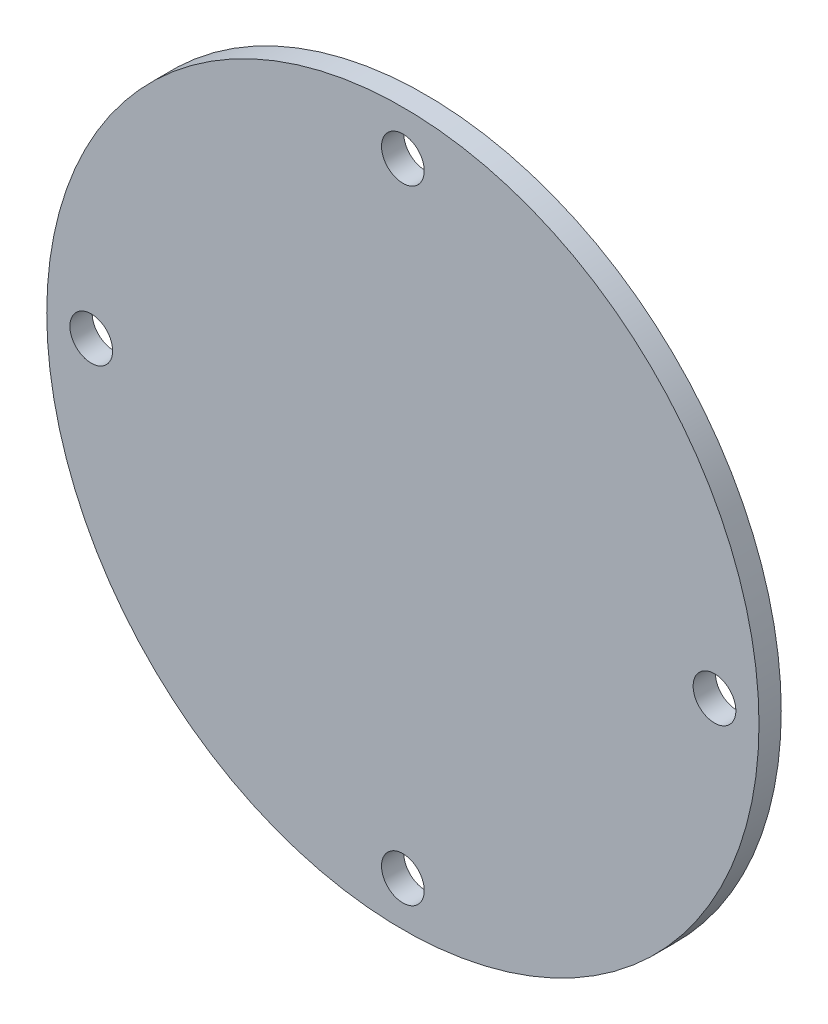
ISO-10303-21;
HEADER;
FILE_DESCRIPTION(('STEP AP214'),'2;1');
FILE_NAME('part.step','',(''),(''),'','','');
FILE_SCHEMA(('AUTOMOTIVE_DESIGN { 1 0 10303 214 1 1 1 1 }'));
ENDSEC;
DATA;
#1=APPLICATION_CONTEXT('core data for automotive mechanical design processes');
#2=APPLICATION_PROTOCOL_DEFINITION('international standard','automotive_design',2000,#1);
#3=PRODUCT_CONTEXT('',#1,'mechanical');
#4=PRODUCT('Part','Part','',(#3));
#5=PRODUCT_RELATED_PRODUCT_CATEGORY('part','',(#4));
#6=PRODUCT_DEFINITION_FORMATION('','',#4);
#7=PRODUCT_DEFINITION_CONTEXT('part definition',#1,'design');
#8=PRODUCT_DEFINITION('design','',#6,#7);
#9=PRODUCT_DEFINITION_SHAPE('','',#8);
#10=(LENGTH_UNIT() NAMED_UNIT(*) SI_UNIT(.MILLI.,.METRE.));
#11=(NAMED_UNIT(*) PLANE_ANGLE_UNIT() SI_UNIT($,.RADIAN.));
#12=(NAMED_UNIT(*) SI_UNIT($,.STERADIAN.) SOLID_ANGLE_UNIT());
#13=UNCERTAINTY_MEASURE_WITH_UNIT(LENGTH_MEASURE(1.E-05),#10,'distance_accuracy_value','');
#14=(GEOMETRIC_REPRESENTATION_CONTEXT(3) GLOBAL_UNCERTAINTY_ASSIGNED_CONTEXT((#13)) GLOBAL_UNIT_ASSIGNED_CONTEXT((#10,
#11,#12)) REPRESENTATION_CONTEXT('',''));
#15=CARTESIAN_POINT('',(0.,0.,0.));
#16=DIRECTION('',(0.,0.,1.));
#17=DIRECTION('',(1.,0.,0.));
#18=AXIS2_PLACEMENT_3D('',#15,#16,#17);
#19=CARTESIAN_POINT('',(0.,0.,1.5875));
#20=DIRECTION('',(0.,0.,-1.));
#21=DIRECTION('',(-1.,0.,0.));
#22=AXIS2_PLACEMENT_3D('',#19,#20,#21);
#23=CYLINDRICAL_SURFACE('',#22,25.4);
#24=CARTESIAN_POINT('',(0.,0.,1.5875));
#25=DIRECTION('',(0.,0.,1.));
#26=DIRECTION('',(1.,0.,0.));
#27=AXIS2_PLACEMENT_3D('',#24,#25,#26);
#28=CIRCLE('',#27,25.4);
#29=CARTESIAN_POINT('',(25.4,0.,1.5875));
#30=VERTEX_POINT('',#29);
#31=EDGE_CURVE('E10',#30,#30,#28,.T.);
#32=ORIENTED_EDGE('',*,*,#31,.F.);
#33=EDGE_LOOP('',(#32));
#34=FACE_BOUND('',#33,.T.);
#35=CARTESIAN_POINT('',(0.,0.,0.));
#36=DIRECTION('',(0.,0.,1.));
#37=DIRECTION('',(1.,0.,0.));
#38=AXIS2_PLACEMENT_3D('',#35,#36,#37);
#39=CIRCLE('',#38,25.4);
#40=CARTESIAN_POINT('',(25.4,0.,0.));
#41=VERTEX_POINT('',#40);
#42=EDGE_CURVE('E38',#41,#41,#39,.T.);
#43=ORIENTED_EDGE('',*,*,#42,.T.);
#44=EDGE_LOOP('',(#43));
#45=FACE_BOUND('',#44,.T.);
#46=ADVANCED_FACE('F35',(#34,#45),#23,.T.);
#47=CARTESIAN_POINT('',(0.,0.,1.5875));
#48=DIRECTION('',(0.,0.,1.));
#49=DIRECTION('',(1.,0.,0.));
#50=AXIS2_PLACEMENT_3D('',#47,#48,#49);
#51=PLANE('',#50);
#52=CARTESIAN_POINT('',(-22.225,2.32794518267366E-13,1.5875));
#53=DIRECTION('',(0.,0.,1.));
#54=DIRECTION('',(0.,1.,0.));
#55=AXIS2_PLACEMENT_3D('',#52,#53,#54);
#56=CIRCLE('',#55,1.524);
#57=CARTESIAN_POINT('',(-22.225,1.52400000000023,1.5875));
#58=VERTEX_POINT('',#57);
#59=EDGE_CURVE('E71',#58,#58,#56,.T.);
#60=ORIENTED_EDGE('',*,*,#59,.F.);
#61=EDGE_LOOP('',(#60));
#62=FACE_BOUND('',#61,.T.);
#63=CARTESIAN_POINT('',(0.,-22.225,1.5875));
#64=DIRECTION('',(0.,0.,1.));
#65=DIRECTION('',(-1.,0.,0.));
#66=AXIS2_PLACEMENT_3D('',#63,#64,#65);
#67=CIRCLE('',#66,1.524);
#68=CARTESIAN_POINT('',(-1.524,-22.225,1.5875));
#69=VERTEX_POINT('',#68);
#70=EDGE_CURVE('E65',#69,#69,#67,.T.);
#71=ORIENTED_EDGE('',*,*,#70,.F.);
#72=EDGE_LOOP('',(#71));
#73=FACE_BOUND('',#72,.T.);
#74=CARTESIAN_POINT('',(22.225,0.,1.5875));
#75=DIRECTION('',(0.,0.,1.));
#76=DIRECTION('',(0.,-1.,0.));
#77=AXIS2_PLACEMENT_3D('',#74,#75,#76);
#78=CIRCLE('',#77,1.524);
#79=CARTESIAN_POINT('',(22.225,-1.52400000000008,1.5875));
#80=VERTEX_POINT('',#79);
#81=EDGE_CURVE('E57',#80,#80,#78,.T.);
#82=ORIENTED_EDGE('',*,*,#81,.F.);
#83=EDGE_LOOP('',(#82));
#84=FACE_BOUND('',#83,.T.);
#85=CARTESIAN_POINT('',(0.,22.225,1.5875));
#86=DIRECTION('',(0.,0.,1.));
#87=DIRECTION('',(1.,0.,0.));
#88=AXIS2_PLACEMENT_3D('',#85,#86,#87);
#89=CIRCLE('',#88,1.524);
#90=CARTESIAN_POINT('',(1.524,22.225,1.5875));
#91=VERTEX_POINT('',#90);
#92=EDGE_CURVE('E50',#91,#91,#89,.T.);
#93=ORIENTED_EDGE('',*,*,#92,.F.);
#94=EDGE_LOOP('',(#93));
#95=FACE_BOUND('',#94,.T.);
#96=ORIENTED_EDGE('',*,*,#31,.T.);
#97=EDGE_LOOP('',(#96));
#98=FACE_BOUND('',#97,.T.);
#99=ADVANCED_FACE('F87',(#62,#73,#84,#95,#98),#51,.T.);
#100=CARTESIAN_POINT('',(0.,0.,0.));
#101=DIRECTION('',(0.,0.,1.));
#102=DIRECTION('',(1.,0.,0.));
#103=AXIS2_PLACEMENT_3D('',#100,#101,#102);
#104=PLANE('',#103);
#105=CARTESIAN_POINT('',(-22.225,2.32794518267366E-13,0.));
#106=DIRECTION('',(0.,0.,1.));
#107=DIRECTION('',(0.,1.,0.));
#108=AXIS2_PLACEMENT_3D('',#105,#106,#107);
#109=CIRCLE('',#108,1.524);
#110=CARTESIAN_POINT('',(-22.225,1.52400000000023,0.));
#111=VERTEX_POINT('',#110);
#112=EDGE_CURVE('E68',#111,#111,#109,.T.);
#113=ORIENTED_EDGE('',*,*,#112,.T.);
#114=EDGE_LOOP('',(#113));
#115=FACE_BOUND('',#114,.T.);
#116=CARTESIAN_POINT('',(0.,-22.225,0.));
#117=DIRECTION('',(0.,0.,1.));
#118=DIRECTION('',(-1.,0.,0.));
#119=AXIS2_PLACEMENT_3D('',#116,#117,#118);
#120=CIRCLE('',#119,1.524);
#121=CARTESIAN_POINT('',(-1.524,-22.225,0.));
#122=VERTEX_POINT('',#121);
#123=EDGE_CURVE('E61',#122,#122,#120,.T.);
#124=ORIENTED_EDGE('',*,*,#123,.T.);
#125=EDGE_LOOP('',(#124));
#126=FACE_BOUND('',#125,.T.);
#127=CARTESIAN_POINT('',(22.225,0.,0.));
#128=DIRECTION('',(0.,0.,1.));
#129=DIRECTION('',(0.,-1.,0.));
#130=AXIS2_PLACEMENT_3D('',#127,#128,#129);
#131=CIRCLE('',#130,1.524);
#132=CARTESIAN_POINT('',(22.225,-1.52400000000008,0.));
#133=VERTEX_POINT('',#132);
#134=EDGE_CURVE('E54',#133,#133,#131,.T.);
#135=ORIENTED_EDGE('',*,*,#134,.T.);
#136=EDGE_LOOP('',(#135));
#137=FACE_BOUND('',#136,.T.);
#138=CARTESIAN_POINT('',(0.,22.225,0.));
#139=DIRECTION('',(0.,0.,1.));
#140=DIRECTION('',(1.,0.,0.));
#141=AXIS2_PLACEMENT_3D('',#138,#139,#140);
#142=CIRCLE('',#141,1.524);
#143=CARTESIAN_POINT('',(1.524,22.225,0.));
#144=VERTEX_POINT('',#143);
#145=EDGE_CURVE('E48',#144,#144,#142,.T.);
#146=ORIENTED_EDGE('',*,*,#145,.T.);
#147=EDGE_LOOP('',(#146));
#148=FACE_BOUND('',#147,.T.);
#149=ORIENTED_EDGE('',*,*,#42,.F.);
#150=EDGE_LOOP('',(#149));
#151=FACE_BOUND('',#150,.T.);
#152=ADVANCED_FACE('F77',(#115,#126,#137,#148,#151),#104,.F.);
#153=CARTESIAN_POINT('',(0.,22.225,0.));
#154=DIRECTION('',(0.,0.,1.));
#155=DIRECTION('',(1.,0.,0.));
#156=AXIS2_PLACEMENT_3D('',#153,#154,#155);
#157=CYLINDRICAL_SURFACE('',#156,1.524);
#158=ORIENTED_EDGE('',*,*,#145,.F.);
#159=EDGE_LOOP('',(#158));
#160=FACE_BOUND('',#159,.T.);
#161=ORIENTED_EDGE('',*,*,#92,.T.);
#162=EDGE_LOOP('',(#161));
#163=FACE_BOUND('',#162,.T.);
#164=ADVANCED_FACE('F97',(#160,#163),#157,.F.);
#165=CARTESIAN_POINT('',(22.225,0.,0.));
#166=DIRECTION('',(0.,0.,1.));
#167=DIRECTION('',(1.,0.,0.));
#168=AXIS2_PLACEMENT_3D('',#165,#166,#167);
#169=CYLINDRICAL_SURFACE('',#168,1.524);
#170=ORIENTED_EDGE('',*,*,#134,.F.);
#171=EDGE_LOOP('',(#170));
#172=FACE_BOUND('',#171,.T.);
#173=ORIENTED_EDGE('',*,*,#81,.T.);
#174=EDGE_LOOP('',(#173));
#175=FACE_BOUND('',#174,.T.);
#176=ADVANCED_FACE('F99',(#172,#175),#169,.F.);
#177=CARTESIAN_POINT('',(0.,-22.225,0.));
#178=DIRECTION('',(0.,0.,1.));
#179=DIRECTION('',(1.,0.,0.));
#180=AXIS2_PLACEMENT_3D('',#177,#178,#179);
#181=CYLINDRICAL_SURFACE('',#180,1.524);
#182=ORIENTED_EDGE('',*,*,#123,.F.);
#183=EDGE_LOOP('',(#182));
#184=FACE_BOUND('',#183,.T.);
#185=ORIENTED_EDGE('',*,*,#70,.T.);
#186=EDGE_LOOP('',(#185));
#187=FACE_BOUND('',#186,.T.);
#188=ADVANCED_FACE('F83',(#184,#187),#181,.F.);
#189=CARTESIAN_POINT('',(-22.225,2.32794518267366E-13,0.));
#190=DIRECTION('',(0.,0.,1.));
#191=DIRECTION('',(1.,0.,0.));
#192=AXIS2_PLACEMENT_3D('',#189,#190,#191);
#193=CYLINDRICAL_SURFACE('',#192,1.524);
#194=ORIENTED_EDGE('',*,*,#112,.F.);
#195=EDGE_LOOP('',(#194));
#196=FACE_BOUND('',#195,.T.);
#197=ORIENTED_EDGE('',*,*,#59,.T.);
#198=EDGE_LOOP('',(#197));
#199=FACE_BOUND('',#198,.T.);
#200=ADVANCED_FACE('F80',(#196,#199),#193,.F.);
#201=CLOSED_SHELL('',(#46,#99,#152,#164,#176,#188,#200));
#202=MANIFOLD_SOLID_BREP('B2',#201);
#203=ADVANCED_BREP_SHAPE_REPRESENTATION('',(#18,#202),#14);
#204=SHAPE_DEFINITION_REPRESENTATION(#9,#203);
ENDSEC;
END-ISO-10303-21;
